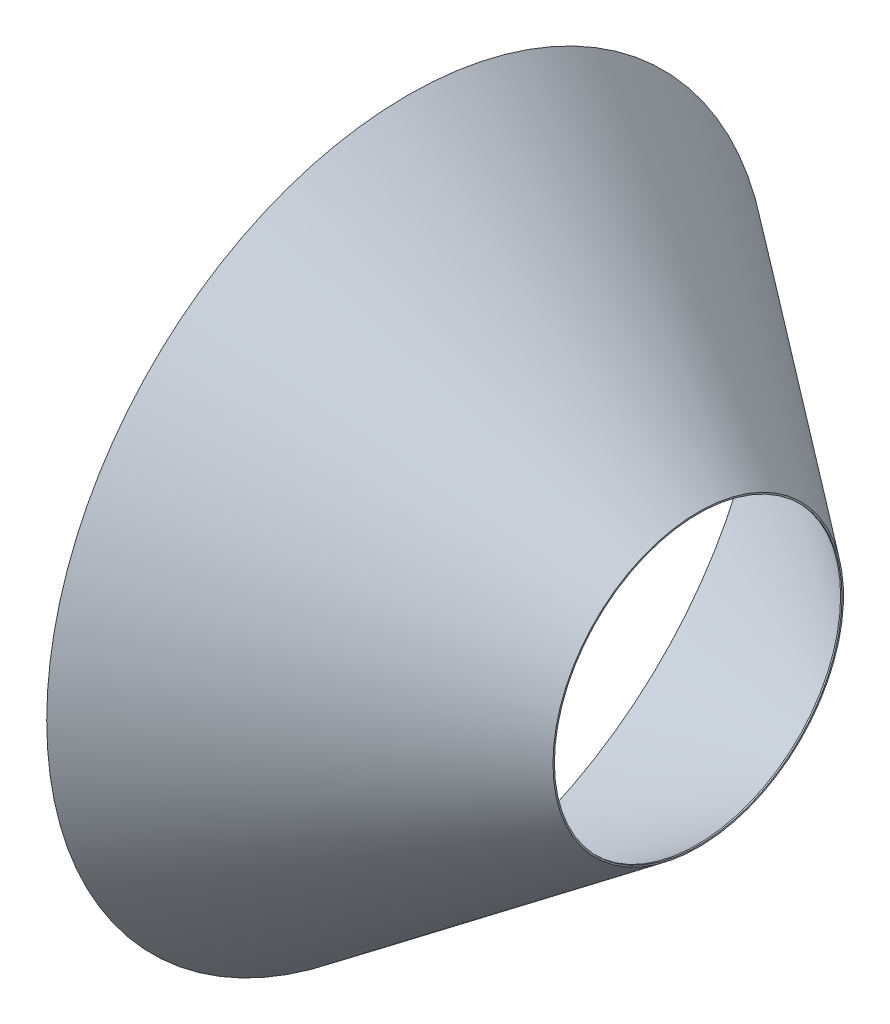
ISO-10303-21;
HEADER;
FILE_DESCRIPTION(('STEP AP214'),'2;1');
FILE_NAME('part.step','',(''),(''),'','','');
FILE_SCHEMA(('AUTOMOTIVE_DESIGN { 1 0 10303 214 1 1 1 1 }'));
ENDSEC;
DATA;
#1=APPLICATION_CONTEXT('core data for automotive mechanical design processes');
#2=APPLICATION_PROTOCOL_DEFINITION('international standard','automotive_design',2000,#1);
#3=PRODUCT_CONTEXT('',#1,'mechanical');
#4=PRODUCT('Part','Part','',(#3));
#5=PRODUCT_RELATED_PRODUCT_CATEGORY('part','',(#4));
#6=PRODUCT_DEFINITION_FORMATION('','',#4);
#7=PRODUCT_DEFINITION_CONTEXT('part definition',#1,'design');
#8=PRODUCT_DEFINITION('design','',#6,#7);
#9=PRODUCT_DEFINITION_SHAPE('','',#8);
#10=(LENGTH_UNIT() NAMED_UNIT(*) SI_UNIT(.MILLI.,.METRE.));
#11=(NAMED_UNIT(*) PLANE_ANGLE_UNIT() SI_UNIT($,.RADIAN.));
#12=(NAMED_UNIT(*) SI_UNIT($,.STERADIAN.) SOLID_ANGLE_UNIT());
#13=UNCERTAINTY_MEASURE_WITH_UNIT(LENGTH_MEASURE(1.E-05),#10,'distance_accuracy_value','');
#14=(GEOMETRIC_REPRESENTATION_CONTEXT(3) GLOBAL_UNCERTAINTY_ASSIGNED_CONTEXT((#13)) GLOBAL_UNIT_ASSIGNED_CONTEXT((#10,
#11,#12)) REPRESENTATION_CONTEXT('',''));
#15=CARTESIAN_POINT('',(0.,0.,0.));
#16=DIRECTION('',(0.,0.,1.));
#17=DIRECTION('',(1.,0.,0.));
#18=AXIS2_PLACEMENT_3D('',#15,#16,#17);
#19=CARTESIAN_POINT('',(0.5,251.,0.));
#20=DIRECTION('',(-1.,0.,0.));
#21=DIRECTION('',(0.,0.,1.));
#22=AXIS2_PLACEMENT_3D('',#19,#20,#21);
#23=CONICAL_SURFACE('',#22,248.886138613861,0.638731669600255);
#24=CARTESIAN_POINT('',(201.,251.,0.));
#25=DIRECTION('',(1.,0.,0.));
#26=DIRECTION('',(0.,0.,-1.));
#27=AXIS2_PLACEMENT_3D('',#24,#25,#26);
#28=CIRCLE('',#27,100.);
#29=CARTESIAN_POINT('',(201.,251.,-100.));
#30=VERTEX_POINT('',#29);
#31=EDGE_CURVE('E66',#30,#30,#28,.T.);
#32=ORIENTED_EDGE('',*,*,#31,.T.);
#33=EDGE_LOOP('',(#32));
#34=FACE_BOUND('',#33,.T.);
#35=CARTESIAN_POINT('',(1.,251.,0.));
#36=DIRECTION('',(-1.,0.,0.));
#37=DIRECTION('',(0.,0.,1.));
#38=AXIS2_PLACEMENT_3D('',#35,#36,#37);
#39=CIRCLE('',#38,248.514851485148);
#40=CARTESIAN_POINT('',(1.,251.,248.514851485148));
#41=VERTEX_POINT('',#40);
#42=EDGE_CURVE('E10',#41,#41,#39,.F.);
#43=ORIENTED_EDGE('',*,*,#42,.F.);
#44=EDGE_LOOP('',(#43));
#45=FACE_BOUND('',#44,.T.);
#46=ADVANCED_FACE('F39',(#34,#45),#23,.F.);
#47=CARTESIAN_POINT('',(192.,251.,0.));
#48=DIRECTION('',(1.,0.,0.));
#49=DIRECTION('',(0.,0.,-1.));
#50=AXIS2_PLACEMENT_3D('',#47,#48,#49);
#51=CYLINDRICAL_SURFACE('',#50,100.);
#52=CARTESIAN_POINT('',(202.,251.,0.));
#53=DIRECTION('',(1.,0.,0.));
#54=DIRECTION('',(0.,0.,-1.));
#55=AXIS2_PLACEMENT_3D('',#52,#53,#54);
#56=CIRCLE('',#55,100.);
#57=CARTESIAN_POINT('',(202.,251.,-100.));
#58=VERTEX_POINT('',#57);
#59=EDGE_CURVE('E53',#58,#58,#56,.T.);
#60=ORIENTED_EDGE('',*,*,#59,.T.);
#61=EDGE_LOOP('',(#60));
#62=FACE_BOUND('',#61,.T.);
#63=ORIENTED_EDGE('',*,*,#31,.F.);
#64=EDGE_LOOP('',(#63));
#65=FACE_BOUND('',#64,.T.);
#66=ADVANCED_FACE('F73',(#62,#65),#51,.F.);
#67=CARTESIAN_POINT('',(0.,251.,0.));
#68=DIRECTION('',(-1.,0.,0.));
#69=DIRECTION('',(0.,0.,1.));
#70=AXIS2_PLACEMENT_3D('',#67,#68,#69);
#71=CONICAL_SURFACE('',#70,251.,0.638731669600255);
#72=CARTESIAN_POINT('',(202.,251.,0.));
#73=DIRECTION('',(-1.,0.,0.));
#74=DIRECTION('',(0.,0.,1.));
#75=AXIS2_PLACEMENT_3D('',#72,#73,#74);
#76=CIRCLE('',#75,101.);
#77=CARTESIAN_POINT('',(202.,251.,101.));
#78=VERTEX_POINT('',#77);
#79=EDGE_CURVE('E60',#78,#78,#76,.T.);
#80=ORIENTED_EDGE('',*,*,#79,.T.);
#81=EDGE_LOOP('',(#80));
#82=FACE_BOUND('',#81,.T.);
#83=CARTESIAN_POINT('',(0.,251.,0.));
#84=DIRECTION('',(-1.,0.,0.));
#85=DIRECTION('',(0.,0.,1.));
#86=AXIS2_PLACEMENT_3D('',#83,#84,#85);
#87=CIRCLE('',#86,251.);
#88=CARTESIAN_POINT('',(0.,251.,251.));
#89=VERTEX_POINT('',#88);
#90=EDGE_CURVE('E56',#89,#89,#87,.T.);
#91=ORIENTED_EDGE('',*,*,#90,.F.);
#92=EDGE_LOOP('',(#91));
#93=FACE_BOUND('',#92,.T.);
#94=ADVANCED_FACE('F84',(#82,#93),#71,.T.);
#95=CARTESIAN_POINT('',(0.,0.,0.));
#96=DIRECTION('',(-1.,0.,0.));
#97=DIRECTION('',(0.,0.,1.));
#98=AXIS2_PLACEMENT_3D('',#95,#96,#97);
#99=PLANE('',#98);
#100=CARTESIAN_POINT('',(0.,251.,0.));
#101=DIRECTION('',(-1.,0.,0.));
#102=DIRECTION('',(0.,0.,1.));
#103=AXIS2_PLACEMENT_3D('',#100,#101,#102);
#104=CIRCLE('',#103,250.);
#105=CARTESIAN_POINT('',(0.,251.,250.));
#106=VERTEX_POINT('',#105);
#107=EDGE_CURVE('E51',#106,#106,#104,.T.);
#108=ORIENTED_EDGE('',*,*,#107,.F.);
#109=EDGE_LOOP('',(#108));
#110=FACE_BOUND('',#109,.T.);
#111=ORIENTED_EDGE('',*,*,#90,.T.);
#112=EDGE_LOOP('',(#111));
#113=FACE_BOUND('',#112,.T.);
#114=ADVANCED_FACE('F80',(#110,#113),#99,.T.);
#115=CARTESIAN_POINT('',(202.,251.,0.));
#116=DIRECTION('',(1.,0.,0.));
#117=DIRECTION('',(0.,0.,-1.));
#118=AXIS2_PLACEMENT_3D('',#115,#116,#117);
#119=PLANE('',#118);
#120=ORIENTED_EDGE('',*,*,#59,.F.);
#121=EDGE_LOOP('',(#120));
#122=FACE_BOUND('',#121,.T.);
#123=ORIENTED_EDGE('',*,*,#79,.F.);
#124=EDGE_LOOP('',(#123));
#125=FACE_BOUND('',#124,.T.);
#126=ADVANCED_FACE('F76',(#122,#125),#119,.T.);
#127=CARTESIAN_POINT('',(1.,251.,0.));
#128=DIRECTION('',(-1.,0.,0.));
#129=DIRECTION('',(0.,0.,1.));
#130=AXIS2_PLACEMENT_3D('',#127,#128,#129);
#131=CYLINDRICAL_SURFACE('',#130,250.);
#132=CARTESIAN_POINT('',(1.,251.,0.));
#133=DIRECTION('',(-1.,0.,0.));
#134=DIRECTION('',(0.,0.,1.));
#135=AXIS2_PLACEMENT_3D('',#132,#133,#134);
#136=CIRCLE('',#135,250.);
#137=CARTESIAN_POINT('',(1.,251.,250.));
#138=VERTEX_POINT('',#137);
#139=EDGE_CURVE('E43',#138,#138,#136,.T.);
#140=ORIENTED_EDGE('',*,*,#139,.F.);
#141=EDGE_LOOP('',(#140));
#142=FACE_BOUND('',#141,.T.);
#143=ORIENTED_EDGE('',*,*,#107,.T.);
#144=EDGE_LOOP('',(#143));
#145=FACE_BOUND('',#144,.T.);
#146=ADVANCED_FACE('F79',(#142,#145),#131,.F.);
#147=CARTESIAN_POINT('',(1.,251.,0.));
#148=DIRECTION('',(-1.,0.,0.));
#149=DIRECTION('',(0.,0.,1.));
#150=AXIS2_PLACEMENT_3D('',#147,#148,#149);
#151=PLANE('',#150);
#152=ORIENTED_EDGE('',*,*,#139,.T.);
#153=EDGE_LOOP('',(#152));
#154=FACE_BOUND('',#153,.T.);
#155=ORIENTED_EDGE('',*,*,#42,.T.);
#156=EDGE_LOOP('',(#155));
#157=FACE_BOUND('',#156,.T.);
#158=ADVANCED_FACE('F41',(#154,#157),#151,.T.);
#159=CLOSED_SHELL('',(#46,#66,#94,#114,#126,#146,#158));
#160=MANIFOLD_SOLID_BREP('B2',#159);
#161=ADVANCED_BREP_SHAPE_REPRESENTATION('',(#18,#160),#14);
#162=SHAPE_DEFINITION_REPRESENTATION(#9,#161);
ENDSEC;
END-ISO-10303-21;
